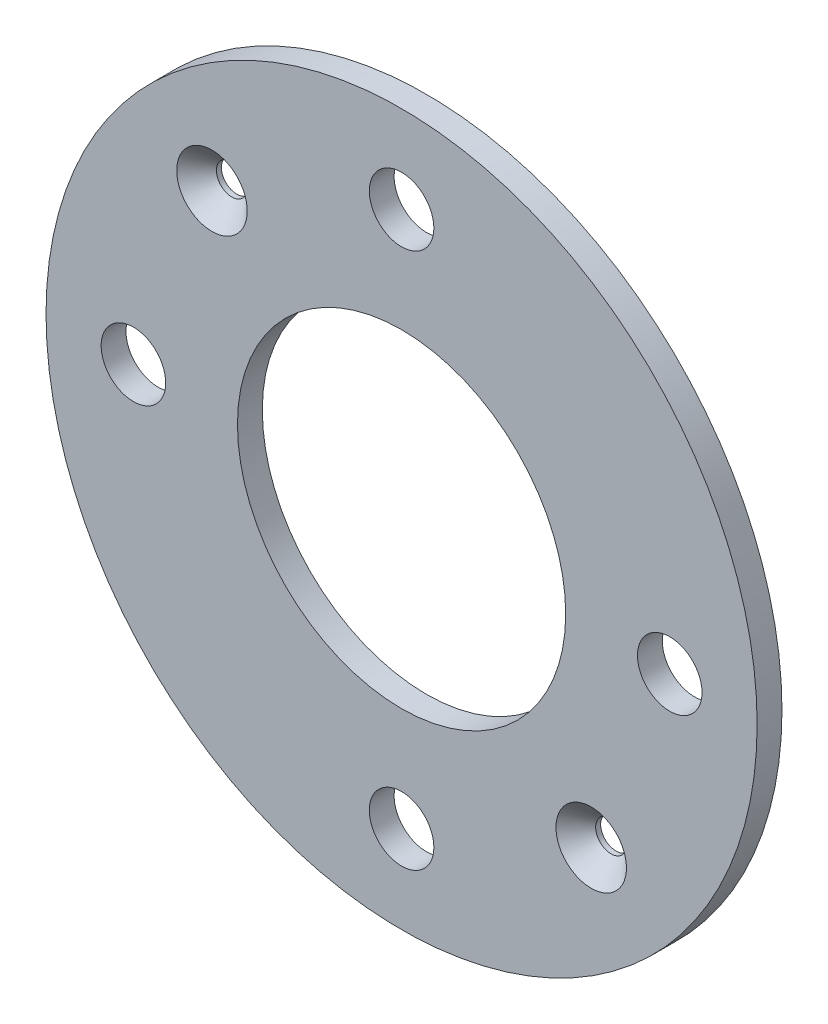
ISO-10303-21;
HEADER;
FILE_DESCRIPTION(('STEP AP214'),'2;1');
FILE_NAME('part.step','',(''),(''),'','','');
FILE_SCHEMA(('AUTOMOTIVE_DESIGN { 1 0 10303 214 1 1 1 1 }'));
ENDSEC;
DATA;
#1=APPLICATION_CONTEXT('core data for automotive mechanical design processes');
#2=APPLICATION_PROTOCOL_DEFINITION('international standard','automotive_design',2000,#1);
#3=PRODUCT_CONTEXT('',#1,'mechanical');
#4=PRODUCT('Part','Part','',(#3));
#5=PRODUCT_RELATED_PRODUCT_CATEGORY('part','',(#4));
#6=PRODUCT_DEFINITION_FORMATION('','',#4);
#7=PRODUCT_DEFINITION_CONTEXT('part definition',#1,'design');
#8=PRODUCT_DEFINITION('design','',#6,#7);
#9=PRODUCT_DEFINITION_SHAPE('','',#8);
#10=(LENGTH_UNIT() NAMED_UNIT(*) SI_UNIT(.MILLI.,.METRE.));
#11=(NAMED_UNIT(*) PLANE_ANGLE_UNIT() SI_UNIT($,.RADIAN.));
#12=(NAMED_UNIT(*) SI_UNIT($,.STERADIAN.) SOLID_ANGLE_UNIT());
#13=UNCERTAINTY_MEASURE_WITH_UNIT(LENGTH_MEASURE(1.E-05),#10,'distance_accuracy_value','');
#14=(GEOMETRIC_REPRESENTATION_CONTEXT(3) GLOBAL_UNCERTAINTY_ASSIGNED_CONTEXT((#13)) GLOBAL_UNIT_ASSIGNED_CONTEXT((#10,
#11,#12)) REPRESENTATION_CONTEXT('',''));
#15=CARTESIAN_POINT('',(0.,0.,0.));
#16=DIRECTION('',(0.,0.,1.));
#17=DIRECTION('',(1.,0.,0.));
#18=AXIS2_PLACEMENT_3D('',#15,#16,#17);
#19=CARTESIAN_POINT('',(0.,0.,5.));
#20=DIRECTION('',(0.,0.,1.));
#21=DIRECTION('',(1.,0.,0.));
#22=AXIS2_PLACEMENT_3D('',#19,#20,#21);
#23=PLANE('',#22);
#24=CARTESIAN_POINT('',(38.1837661840734,-38.1837661840738,5.));
#25=DIRECTION('',(0.,0.,1.));
#26=DIRECTION('',(1.,0.,0.));
#27=AXIS2_PLACEMENT_3D('',#24,#25,#26);
#28=CIRCLE('',#27,7.10000000000006);
#29=CARTESIAN_POINT('',(45.2837661840735,-38.1837661840738,5.));
#30=VERTEX_POINT('',#29);
#31=EDGE_CURVE('E41',#30,#30,#28,.F.);
#32=ORIENTED_EDGE('',*,*,#31,.T.);
#33=EDGE_LOOP('',(#32));
#34=FACE_BOUND('',#33,.T.);
#35=CARTESIAN_POINT('',(-38.1837661840734,38.1837661840738,5.));
#36=DIRECTION('',(0.,0.,1.));
#37=DIRECTION('',(1.,0.,0.));
#38=AXIS2_PLACEMENT_3D('',#35,#36,#37);
#39=CIRCLE('',#38,7.10000000000005);
#40=CARTESIAN_POINT('',(-31.0837661840733,38.1837661840738,5.));
#41=VERTEX_POINT('',#40);
#42=EDGE_CURVE('E45',#41,#41,#39,.F.);
#43=ORIENTED_EDGE('',*,*,#42,.T.);
#44=EDGE_LOOP('',(#43));
#45=FACE_BOUND('',#44,.T.);
#46=CARTESIAN_POINT('',(0.,54.,5.));
#47=DIRECTION('',(0.,0.,1.));
#48=DIRECTION('',(1.,0.,0.));
#49=AXIS2_PLACEMENT_3D('',#46,#47,#48);
#50=CIRCLE('',#49,6.5);
#51=CARTESIAN_POINT('',(6.5,54.,5.));
#52=VERTEX_POINT('',#51);
#53=EDGE_CURVE('E86',#52,#52,#50,.T.);
#54=ORIENTED_EDGE('',*,*,#53,.F.);
#55=EDGE_LOOP('',(#54));
#56=FACE_BOUND('',#55,.T.);
#57=CARTESIAN_POINT('',(54.,0.,5.));
#58=DIRECTION('',(0.,0.,1.));
#59=DIRECTION('',(1.,0.,0.));
#60=AXIS2_PLACEMENT_3D('',#57,#58,#59);
#61=CIRCLE('',#60,6.5);
#62=CARTESIAN_POINT('',(60.5,0.,5.));
#63=VERTEX_POINT('',#62);
#64=EDGE_CURVE('E80',#63,#63,#61,.T.);
#65=ORIENTED_EDGE('',*,*,#64,.F.);
#66=EDGE_LOOP('',(#65));
#67=FACE_BOUND('',#66,.T.);
#68=CARTESIAN_POINT('',(-54.,0.,5.));
#69=DIRECTION('',(0.,0.,1.));
#70=DIRECTION('',(1.,0.,0.));
#71=AXIS2_PLACEMENT_3D('',#68,#69,#70);
#72=CIRCLE('',#71,6.5);
#73=CARTESIAN_POINT('',(-47.5,0.,5.));
#74=VERTEX_POINT('',#73);
#75=EDGE_CURVE('E74',#74,#74,#72,.T.);
#76=ORIENTED_EDGE('',*,*,#75,.F.);
#77=EDGE_LOOP('',(#76));
#78=FACE_BOUND('',#77,.T.);
#79=CARTESIAN_POINT('',(0.,-54.,5.));
#80=DIRECTION('',(0.,0.,1.));
#81=DIRECTION('',(1.,0.,0.));
#82=AXIS2_PLACEMENT_3D('',#79,#80,#81);
#83=CIRCLE('',#82,6.5);
#84=CARTESIAN_POINT('',(6.5,-54.,5.));
#85=VERTEX_POINT('',#84);
#86=EDGE_CURVE('E67',#85,#85,#83,.T.);
#87=ORIENTED_EDGE('',*,*,#86,.F.);
#88=EDGE_LOOP('',(#87));
#89=FACE_BOUND('',#88,.T.);
#90=CARTESIAN_POINT('',(0.,0.,5.));
#91=DIRECTION('',(0.,0.,1.));
#92=DIRECTION('',(1.,0.,0.));
#93=AXIS2_PLACEMENT_3D('',#90,#91,#92);
#94=CIRCLE('',#93,71.6);
#95=CARTESIAN_POINT('',(71.6,0.,5.));
#96=VERTEX_POINT('',#95);
#97=EDGE_CURVE('E54',#96,#96,#94,.T.);
#98=ORIENTED_EDGE('',*,*,#97,.T.);
#99=EDGE_LOOP('',(#98));
#100=FACE_BOUND('',#99,.T.);
#101=CARTESIAN_POINT('',(0.,0.,5.));
#102=DIRECTION('',(0.,0.,1.));
#103=DIRECTION('',(1.,0.,0.));
#104=AXIS2_PLACEMENT_3D('',#101,#102,#103);
#105=CIRCLE('',#104,33.05);
#106=CARTESIAN_POINT('',(33.05,0.,5.));
#107=VERTEX_POINT('',#106);
#108=EDGE_CURVE('E58',#107,#107,#105,.T.);
#109=ORIENTED_EDGE('',*,*,#108,.F.);
#110=EDGE_LOOP('',(#109));
#111=FACE_BOUND('',#110,.T.);
#112=ADVANCED_FACE('F33',(#34,#45,#56,#67,#78,#89,#100,#111),#23,.T.);
#113=CARTESIAN_POINT('',(0.,0.,0.));
#114=DIRECTION('',(0.,0.,1.));
#115=DIRECTION('',(1.,0.,0.));
#116=AXIS2_PLACEMENT_3D('',#113,#114,#115);
#117=PLANE('',#116);
#118=CARTESIAN_POINT('',(-38.1837661840734,38.1837661840738,0.));
#119=DIRECTION('',(0.,0.,1.));
#120=DIRECTION('',(1.,0.,0.));
#121=AXIS2_PLACEMENT_3D('',#118,#119,#120);
#122=CIRCLE('',#121,3.1);
#123=CARTESIAN_POINT('',(-35.0837661840734,38.1837661840738,0.));
#124=VERTEX_POINT('',#123);
#125=EDGE_CURVE('E71',#124,#124,#122,.T.);
#126=ORIENTED_EDGE('',*,*,#125,.T.);
#127=EDGE_LOOP('',(#126));
#128=FACE_BOUND('',#127,.T.);
#129=CARTESIAN_POINT('',(38.1837661840734,-38.1837661840738,0.));
#130=DIRECTION('',(0.,0.,1.));
#131=DIRECTION('',(1.,0.,0.));
#132=AXIS2_PLACEMENT_3D('',#129,#130,#131);
#133=CIRCLE('',#132,3.09999999999999);
#134=CARTESIAN_POINT('',(41.2837661840734,-38.1837661840738,0.));
#135=VERTEX_POINT('',#134);
#136=EDGE_CURVE('E91',#135,#135,#133,.T.);
#137=ORIENTED_EDGE('',*,*,#136,.T.);
#138=EDGE_LOOP('',(#137));
#139=FACE_BOUND('',#138,.T.);
#140=CARTESIAN_POINT('',(0.,54.,0.));
#141=DIRECTION('',(0.,0.,1.));
#142=DIRECTION('',(1.,0.,0.));
#143=AXIS2_PLACEMENT_3D('',#140,#141,#142);
#144=CIRCLE('',#143,6.5);
#145=CARTESIAN_POINT('',(6.5,54.,0.));
#146=VERTEX_POINT('',#145);
#147=EDGE_CURVE('E64',#146,#146,#144,.T.);
#148=ORIENTED_EDGE('',*,*,#147,.T.);
#149=EDGE_LOOP('',(#148));
#150=FACE_BOUND('',#149,.T.);
#151=CARTESIAN_POINT('',(54.,0.,0.));
#152=DIRECTION('',(0.,0.,1.));
#153=DIRECTION('',(1.,0.,0.));
#154=AXIS2_PLACEMENT_3D('',#151,#152,#153);
#155=CIRCLE('',#154,6.5);
#156=CARTESIAN_POINT('',(60.5,0.,0.));
#157=VERTEX_POINT('',#156);
#158=EDGE_CURVE('E83',#157,#157,#155,.T.);
#159=ORIENTED_EDGE('',*,*,#158,.T.);
#160=EDGE_LOOP('',(#159));
#161=FACE_BOUND('',#160,.T.);
#162=CARTESIAN_POINT('',(-54.,0.,0.));
#163=DIRECTION('',(0.,0.,1.));
#164=DIRECTION('',(1.,0.,0.));
#165=AXIS2_PLACEMENT_3D('',#162,#163,#164);
#166=CIRCLE('',#165,6.5);
#167=CARTESIAN_POINT('',(-47.5,0.,0.));
#168=VERTEX_POINT('',#167);
#169=EDGE_CURVE('E77',#168,#168,#166,.T.);
#170=ORIENTED_EDGE('',*,*,#169,.T.);
#171=EDGE_LOOP('',(#170));
#172=FACE_BOUND('',#171,.T.);
#173=CARTESIAN_POINT('',(0.,-54.,0.));
#174=DIRECTION('',(0.,0.,1.));
#175=DIRECTION('',(1.,0.,0.));
#176=AXIS2_PLACEMENT_3D('',#173,#174,#175);
#177=CIRCLE('',#176,6.5);
#178=CARTESIAN_POINT('',(6.5,-54.,0.));
#179=VERTEX_POINT('',#178);
#180=EDGE_CURVE('E70',#179,#179,#177,.T.);
#181=ORIENTED_EDGE('',*,*,#180,.T.);
#182=EDGE_LOOP('',(#181));
#183=FACE_BOUND('',#182,.T.);
#184=CARTESIAN_POINT('',(0.,0.,0.));
#185=DIRECTION('',(0.,0.,1.));
#186=DIRECTION('',(1.,0.,0.));
#187=AXIS2_PLACEMENT_3D('',#184,#185,#186);
#188=CIRCLE('',#187,71.6);
#189=CARTESIAN_POINT('',(71.6,0.,0.));
#190=VERTEX_POINT('',#189);
#191=EDGE_CURVE('E55',#190,#190,#188,.T.);
#192=ORIENTED_EDGE('',*,*,#191,.F.);
#193=EDGE_LOOP('',(#192));
#194=FACE_BOUND('',#193,.T.);
#195=CARTESIAN_POINT('',(0.,0.,0.));
#196=DIRECTION('',(0.,0.,1.));
#197=DIRECTION('',(1.,0.,0.));
#198=AXIS2_PLACEMENT_3D('',#195,#196,#197);
#199=CIRCLE('',#198,33.05);
#200=CARTESIAN_POINT('',(33.05,0.,0.));
#201=VERTEX_POINT('',#200);
#202=EDGE_CURVE('E61',#201,#201,#199,.T.);
#203=ORIENTED_EDGE('',*,*,#202,.T.);
#204=EDGE_LOOP('',(#203));
#205=FACE_BOUND('',#204,.T.);
#206=ADVANCED_FACE('F97',(#128,#139,#150,#161,#172,#183,#194,#205),#117,.F.);
#207=CARTESIAN_POINT('',(0.,0.,5.));
#208=DIRECTION('',(0.,0.,-1.));
#209=DIRECTION('',(-1.,0.,0.));
#210=AXIS2_PLACEMENT_3D('',#207,#208,#209);
#211=CYLINDRICAL_SURFACE('',#210,71.6);
#212=ORIENTED_EDGE('',*,*,#97,.F.);
#213=EDGE_LOOP('',(#212));
#214=FACE_BOUND('',#213,.T.);
#215=ORIENTED_EDGE('',*,*,#191,.T.);
#216=EDGE_LOOP('',(#215));
#217=FACE_BOUND('',#216,.T.);
#218=ADVANCED_FACE('F118',(#214,#217),#211,.T.);
#219=CARTESIAN_POINT('',(0.,0.,5.));
#220=DIRECTION('',(0.,0.,-1.));
#221=DIRECTION('',(-1.,0.,0.));
#222=AXIS2_PLACEMENT_3D('',#219,#220,#221);
#223=CYLINDRICAL_SURFACE('',#222,33.05);
#224=ORIENTED_EDGE('',*,*,#108,.T.);
#225=EDGE_LOOP('',(#224));
#226=FACE_BOUND('',#225,.T.);
#227=ORIENTED_EDGE('',*,*,#202,.F.);
#228=EDGE_LOOP('',(#227));
#229=FACE_BOUND('',#228,.T.);
#230=ADVANCED_FACE('F122',(#226,#229),#223,.F.);
#231=CARTESIAN_POINT('',(0.,-54.,0.));
#232=DIRECTION('',(0.,0.,1.));
#233=DIRECTION('',(1.,0.,0.));
#234=AXIS2_PLACEMENT_3D('',#231,#232,#233);
#235=CYLINDRICAL_SURFACE('',#234,6.5);
#236=ORIENTED_EDGE('',*,*,#180,.F.);
#237=EDGE_LOOP('',(#236));
#238=FACE_BOUND('',#237,.T.);
#239=ORIENTED_EDGE('',*,*,#86,.T.);
#240=EDGE_LOOP('',(#239));
#241=FACE_BOUND('',#240,.T.);
#242=ADVANCED_FACE('F135',(#238,#241),#235,.F.);
#243=CARTESIAN_POINT('',(-54.,0.,0.));
#244=DIRECTION('',(0.,0.,1.));
#245=DIRECTION('',(1.,0.,0.));
#246=AXIS2_PLACEMENT_3D('',#243,#244,#245);
#247=CYLINDRICAL_SURFACE('',#246,6.5);
#248=ORIENTED_EDGE('',*,*,#169,.F.);
#249=EDGE_LOOP('',(#248));
#250=FACE_BOUND('',#249,.T.);
#251=ORIENTED_EDGE('',*,*,#75,.T.);
#252=EDGE_LOOP('',(#251));
#253=FACE_BOUND('',#252,.T.);
#254=ADVANCED_FACE('F150',(#250,#253),#247,.F.);
#255=CARTESIAN_POINT('',(54.,0.,0.));
#256=DIRECTION('',(0.,0.,1.));
#257=DIRECTION('',(1.,0.,0.));
#258=AXIS2_PLACEMENT_3D('',#255,#256,#257);
#259=CYLINDRICAL_SURFACE('',#258,6.5);
#260=ORIENTED_EDGE('',*,*,#158,.F.);
#261=EDGE_LOOP('',(#260));
#262=FACE_BOUND('',#261,.T.);
#263=ORIENTED_EDGE('',*,*,#64,.T.);
#264=EDGE_LOOP('',(#263));
#265=FACE_BOUND('',#264,.T.);
#266=ADVANCED_FACE('F155',(#262,#265),#259,.F.);
#267=CARTESIAN_POINT('',(0.,54.,0.));
#268=DIRECTION('',(0.,0.,1.));
#269=DIRECTION('',(1.,0.,0.));
#270=AXIS2_PLACEMENT_3D('',#267,#268,#269);
#271=CYLINDRICAL_SURFACE('',#270,6.5);
#272=ORIENTED_EDGE('',*,*,#147,.F.);
#273=EDGE_LOOP('',(#272));
#274=FACE_BOUND('',#273,.T.);
#275=ORIENTED_EDGE('',*,*,#53,.T.);
#276=EDGE_LOOP('',(#275));
#277=FACE_BOUND('',#276,.T.);
#278=ADVANCED_FACE('F110',(#274,#277),#271,.F.);
#279=CARTESIAN_POINT('',(38.1837661840734,-38.1837661840738,0.));
#280=DIRECTION('',(0.,0.,1.));
#281=DIRECTION('',(1.,0.,0.));
#282=AXIS2_PLACEMENT_3D('',#279,#280,#281);
#283=CYLINDRICAL_SURFACE('',#282,3.09999999999999);
#284=CARTESIAN_POINT('',(38.1837661840734,-38.1837661840738,0.999999999999961));
#285=DIRECTION('',(0.,0.,1.));
#286=DIRECTION('',(1.,0.,0.));
#287=AXIS2_PLACEMENT_3D('',#284,#285,#286);
#288=CIRCLE('',#287,3.09999999999999);
#289=CARTESIAN_POINT('',(41.2837661840734,-38.1837661840738,0.999999999999961));
#290=VERTEX_POINT('',#289);
#291=EDGE_CURVE('E49',#290,#290,#288,.T.);
#292=ORIENTED_EDGE('',*,*,#291,.T.);
#293=EDGE_LOOP('',(#292));
#294=FACE_BOUND('',#293,.T.);
#295=ORIENTED_EDGE('',*,*,#136,.F.);
#296=EDGE_LOOP('',(#295));
#297=FACE_BOUND('',#296,.T.);
#298=ADVANCED_FACE('F103',(#294,#297),#283,.F.);
#299=CARTESIAN_POINT('',(-38.1837661840734,38.1837661840738,0.));
#300=DIRECTION('',(0.,0.,1.));
#301=DIRECTION('',(1.,0.,0.));
#302=AXIS2_PLACEMENT_3D('',#299,#300,#301);
#303=CYLINDRICAL_SURFACE('',#302,3.1);
#304=CARTESIAN_POINT('',(-38.1837661840734,38.1837661840738,0.999999999999969));
#305=DIRECTION('',(0.,0.,1.));
#306=DIRECTION('',(1.,0.,0.));
#307=AXIS2_PLACEMENT_3D('',#304,#305,#306);
#308=CIRCLE('',#307,3.1);
#309=CARTESIAN_POINT('',(-35.0837661840734,38.1837661840738,0.999999999999969));
#310=VERTEX_POINT('',#309);
#311=EDGE_CURVE('E10',#310,#310,#308,.T.);
#312=ORIENTED_EDGE('',*,*,#311,.T.);
#313=EDGE_LOOP('',(#312));
#314=FACE_BOUND('',#313,.T.);
#315=ORIENTED_EDGE('',*,*,#125,.F.);
#316=EDGE_LOOP('',(#315));
#317=FACE_BOUND('',#316,.T.);
#318=ADVANCED_FACE('F100',(#314,#317),#303,.F.);
#319=CARTESIAN_POINT('',(38.1837661840734,-38.1837661840738,0.999999999999961));
#320=DIRECTION('',(0.,0.,1.));
#321=DIRECTION('',(1.,0.,0.));
#322=AXIS2_PLACEMENT_3D('',#319,#320,#321);
#323=CONICAL_SURFACE('',#322,3.09999999999999,0.785398163397451);
#324=ORIENTED_EDGE('',*,*,#31,.F.);
#325=EDGE_LOOP('',(#324));
#326=FACE_BOUND('',#325,.T.);
#327=ORIENTED_EDGE('',*,*,#291,.F.);
#328=EDGE_LOOP('',(#327));
#329=FACE_BOUND('',#328,.T.);
#330=ADVANCED_FACE('F102',(#326,#329),#323,.F.);
#331=CARTESIAN_POINT('',(-38.1837661840734,38.1837661840738,0.999999999999969));
#332=DIRECTION('',(0.,0.,1.));
#333=DIRECTION('',(1.,0.,0.));
#334=AXIS2_PLACEMENT_3D('',#331,#332,#333);
#335=CONICAL_SURFACE('',#334,3.1,0.78539816339745);
#336=ORIENTED_EDGE('',*,*,#42,.F.);
#337=EDGE_LOOP('',(#336));
#338=FACE_BOUND('',#337,.T.);
#339=ORIENTED_EDGE('',*,*,#311,.F.);
#340=EDGE_LOOP('',(#339));
#341=FACE_BOUND('',#340,.T.);
#342=ADVANCED_FACE('F36',(#338,#341),#335,.F.);
#343=CLOSED_SHELL('',(#112,#206,#218,#230,#242,#254,#266,#278,#298,#318,#330,#342));
#344=MANIFOLD_SOLID_BREP('B2',#343);
#345=ADVANCED_BREP_SHAPE_REPRESENTATION('',(#18,#344),#14);
#346=SHAPE_DEFINITION_REPRESENTATION(#9,#345);
ENDSEC;
END-ISO-10303-21;
